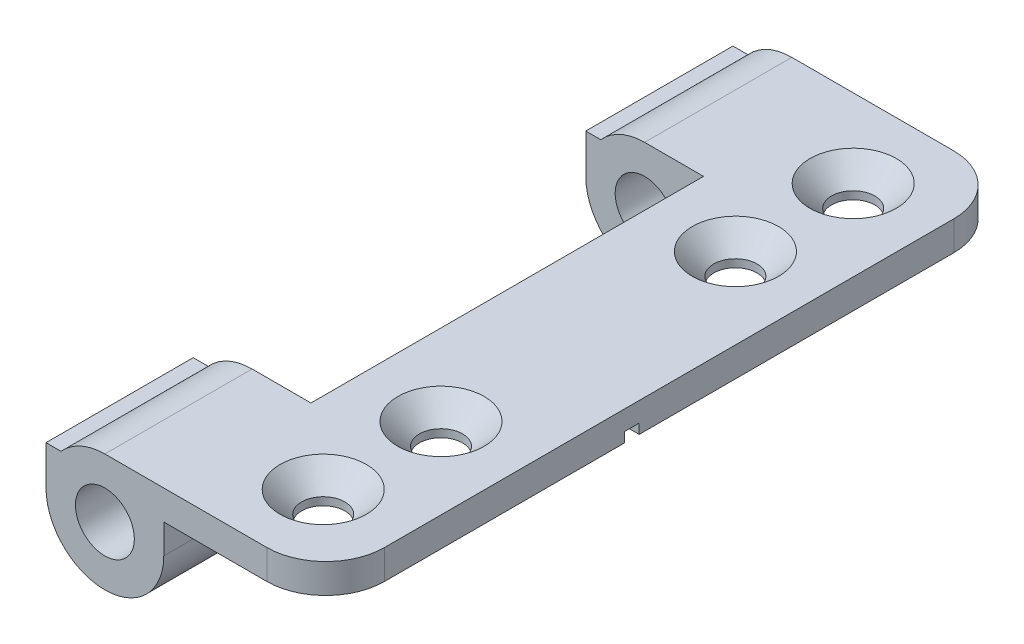
ISO-10303-21;
HEADER;
FILE_DESCRIPTION(('STEP AP214'),'2;1');
FILE_NAME('part.step','',(''),(''),'','','');
FILE_SCHEMA(('AUTOMOTIVE_DESIGN { 1 0 10303 214 1 1 1 1 }'));
ENDSEC;
DATA;
#1=APPLICATION_CONTEXT('core data for automotive mechanical design processes');
#2=APPLICATION_PROTOCOL_DEFINITION('international standard','automotive_design',2000,#1);
#3=PRODUCT_CONTEXT('',#1,'mechanical');
#4=PRODUCT('Part','Part','',(#3));
#5=PRODUCT_RELATED_PRODUCT_CATEGORY('part','',(#4));
#6=PRODUCT_DEFINITION_FORMATION('','',#4);
#7=PRODUCT_DEFINITION_CONTEXT('part definition',#1,'design');
#8=PRODUCT_DEFINITION('design','',#6,#7);
#9=PRODUCT_DEFINITION_SHAPE('','',#8);
#10=(LENGTH_UNIT() NAMED_UNIT(*) SI_UNIT(.MILLI.,.METRE.));
#11=(NAMED_UNIT(*) PLANE_ANGLE_UNIT() SI_UNIT($,.RADIAN.));
#12=(NAMED_UNIT(*) SI_UNIT($,.STERADIAN.) SOLID_ANGLE_UNIT());
#13=UNCERTAINTY_MEASURE_WITH_UNIT(LENGTH_MEASURE(1.E-05),#10,'distance_accuracy_value','');
#14=(GEOMETRIC_REPRESENTATION_CONTEXT(3) GLOBAL_UNCERTAINTY_ASSIGNED_CONTEXT((#13)) GLOBAL_UNIT_ASSIGNED_CONTEXT((#10,
#11,#12)) REPRESENTATION_CONTEXT('',''));
#15=CARTESIAN_POINT('',(0.,0.,0.));
#16=DIRECTION('',(0.,0.,1.));
#17=DIRECTION('',(1.,0.,0.));
#18=AXIS2_PLACEMENT_3D('',#15,#16,#17);
#19=CARTESIAN_POINT('',(11.25,1.5,7.5));
#20=DIRECTION('',(0.,1.,0.));
#21=DIRECTION('',(-1.,0.,0.));
#22=AXIS2_PLACEMENT_3D('',#19,#20,#21);
#23=PLANE('',#22);
#24=CARTESIAN_POINT('',(7.125,1.5,4.));
#25=DIRECTION('',(0.,-1.,0.));
#26=DIRECTION('',(1.,0.,0.));
#27=AXIS2_PLACEMENT_3D('',#24,#25,#26);
#28=CIRCLE('',#27,1.1);
#29=CARTESIAN_POINT('',(8.225,1.5,4.));
#30=VERTEX_POINT('',#29);
#31=EDGE_CURVE('E513',#30,#30,#28,.T.);
#32=ORIENTED_EDGE('',*,*,#31,.F.);
#33=EDGE_LOOP('',(#32));
#34=FACE_BOUND('',#33,.T.);
#35=CARTESIAN_POINT('',(7.125,1.5,10.));
#36=DIRECTION('',(0.,-1.,0.));
#37=DIRECTION('',(1.,0.,0.));
#38=AXIS2_PLACEMENT_3D('',#35,#36,#37);
#39=CIRCLE('',#38,1.1);
#40=CARTESIAN_POINT('',(8.225,1.5,10.));
#41=VERTEX_POINT('',#40);
#42=EDGE_CURVE('E516',#41,#41,#39,.T.);
#43=ORIENTED_EDGE('',*,*,#42,.F.);
#44=EDGE_LOOP('',(#43));
#45=FACE_BOUND('',#44,.T.);
#46=DIRECTION('',(1.,0.,0.));
#47=VECTOR('',#46,1.);
#48=CARTESIAN_POINT('',(11.25,1.5,0.));
#49=LINE('',#48,#47);
#50=CARTESIAN_POINT('',(3.,1.5,0.));
#51=VERTEX_POINT('',#50);
#52=CARTESIAN_POINT('',(8.25,1.5,0.));
#53=VERTEX_POINT('',#52);
#54=EDGE_CURVE('E438',#51,#53,#49,.T.);
#55=ORIENTED_EDGE('',*,*,#54,.T.);
#56=CARTESIAN_POINT('',(8.25,1.5,3.));
#57=DIRECTION('',(0.,1.,0.));
#58=DIRECTION('',(-1.,0.,0.));
#59=AXIS2_PLACEMENT_3D('',#56,#57,#58);
#60=CIRCLE('',#59,3.);
#61=CARTESIAN_POINT('',(11.25,1.5,3.));
#62=VERTEX_POINT('',#61);
#63=EDGE_CURVE('E216',#53,#62,#60,.F.);
#64=ORIENTED_EDGE('',*,*,#63,.T.);
#65=DIRECTION('',(0.,0.,-1.));
#66=VECTOR('',#65,1.);
#67=CARTESIAN_POINT('',(11.25,1.5,7.5));
#68=LINE('',#67,#66);
#69=CARTESIAN_POINT('',(11.25,1.5,19.025));
#70=VERTEX_POINT('',#69);
#71=EDGE_CURVE('E207',#70,#62,#68,.T.);
#72=ORIENTED_EDGE('',*,*,#71,.F.);
#73=DIRECTION('',(-1.,0.,0.));
#74=VECTOR('',#73,1.);
#75=CARTESIAN_POINT('',(11.25,1.5,19.025));
#76=LINE('',#75,#74);
#77=CARTESIAN_POINT('',(3.,1.5,19.025));
#78=VERTEX_POINT('',#77);
#79=EDGE_CURVE('E189',#70,#78,#76,.T.);
#80=ORIENTED_EDGE('',*,*,#79,.T.);
#81=DIRECTION('',(0.,0.,-1.));
#82=VECTOR('',#81,1.);
#83=CARTESIAN_POINT('',(3.,1.5,27.5));
#84=LINE('',#83,#82);
#85=CARTESIAN_POINT('',(3.,1.5,7.5));
#86=VERTEX_POINT('',#85);
#87=EDGE_CURVE('E384',#78,#86,#84,.T.);
#88=ORIENTED_EDGE('',*,*,#87,.T.);
#89=DIRECTION('',(0.,0.,-1.));
#90=VECTOR('',#89,1.);
#91=CARTESIAN_POINT('',(3.,1.5,7.5));
#92=LINE('',#91,#90);
#93=EDGE_CURVE('E223',#86,#51,#92,.T.);
#94=ORIENTED_EDGE('',*,*,#93,.T.);
#95=EDGE_LOOP('',(#55,#64,#72,#80,#88,#94));
#96=FACE_BOUND('',#95,.T.);
#97=ADVANCED_FACE('F43',(#34,#45,#96),#23,.F.);
#98=CARTESIAN_POINT('',(0.,0.,7.5));
#99=DIRECTION('',(0.,0.,1.));
#100=DIRECTION('',(1.,0.,0.));
#101=AXIS2_PLACEMENT_3D('',#98,#99,#100);
#102=PLANE('',#101);
#103=DIRECTION('',(0.,-1.,0.));
#104=VECTOR('',#103,1.);
#105=CARTESIAN_POINT('',(3.,3.,7.5));
#106=LINE('',#105,#104);
#107=CARTESIAN_POINT('',(3.,3.,7.5));
#108=VERTEX_POINT('',#107);
#109=EDGE_CURVE('E379',#108,#86,#106,.T.);
#110=ORIENTED_EDGE('',*,*,#109,.F.);
#111=DIRECTION('',(-1.,0.,0.));
#112=VECTOR('',#111,1.);
#113=CARTESIAN_POINT('',(0.,3.,7.5));
#114=LINE('',#113,#112);
#115=CARTESIAN_POINT('',(0.,3.,7.5));
#116=VERTEX_POINT('',#115);
#117=EDGE_CURVE('E405',#108,#116,#114,.T.);
#118=ORIENTED_EDGE('',*,*,#117,.T.);
#119=CARTESIAN_POINT('',(0.,0.,7.5));
#120=DIRECTION('',(0.,0.,1.));
#121=DIRECTION('',(1.,0.,0.));
#122=AXIS2_PLACEMENT_3D('',#119,#120,#121);
#123=CIRCLE('',#122,3.);
#124=CARTESIAN_POINT('',(-2.23606797749979,2.,7.5));
#125=VERTEX_POINT('',#124);
#126=EDGE_CURVE('E408',#116,#125,#123,.T.);
#127=ORIENTED_EDGE('',*,*,#126,.T.);
#128=DIRECTION('',(-1.,0.,0.));
#129=VECTOR('',#128,1.);
#130=CARTESIAN_POINT('',(-3.,2.,7.5));
#131=LINE('',#130,#129);
#132=CARTESIAN_POINT('',(-3.,2.,7.5));
#133=VERTEX_POINT('',#132);
#134=EDGE_CURVE('E412',#125,#133,#131,.T.);
#135=ORIENTED_EDGE('',*,*,#134,.T.);
#136=DIRECTION('',(0.,-1.,0.));
#137=VECTOR('',#136,1.);
#138=CARTESIAN_POINT('',(-3.,0.,7.5));
#139=LINE('',#138,#137);
#140=CARTESIAN_POINT('',(-3.,0.,7.5));
#141=VERTEX_POINT('',#140);
#142=EDGE_CURVE('E415',#133,#141,#139,.T.);
#143=ORIENTED_EDGE('',*,*,#142,.T.);
#144=CARTESIAN_POINT('',(0.,0.,7.5));
#145=DIRECTION('',(0.,0.,1.));
#146=DIRECTION('',(1.,0.,0.));
#147=AXIS2_PLACEMENT_3D('',#144,#145,#146);
#148=CIRCLE('',#147,3.);
#149=CARTESIAN_POINT('',(3.,0.,7.5));
#150=VERTEX_POINT('',#149);
#151=EDGE_CURVE('E418',#141,#150,#148,.T.);
#152=ORIENTED_EDGE('',*,*,#151,.T.);
#153=DIRECTION('',(0.,1.,0.));
#154=VECTOR('',#153,1.);
#155=CARTESIAN_POINT('',(3.,0.,7.5));
#156=LINE('',#155,#154);
#157=EDGE_CURVE('E225',#150,#86,#156,.T.);
#158=ORIENTED_EDGE('',*,*,#157,.T.);
#159=EDGE_LOOP('',(#110,#118,#127,#135,#143,#152,#158));
#160=FACE_BOUND('',#159,.T.);
#161=CARTESIAN_POINT('',(0.,0.,7.5));
#162=DIRECTION('',(0.,0.,1.));
#163=DIRECTION('',(1.,0.,0.));
#164=AXIS2_PLACEMENT_3D('',#161,#162,#163);
#165=CIRCLE('',#164,1.5);
#166=CARTESIAN_POINT('',(1.5,0.,7.5));
#167=VERTEX_POINT('',#166);
#168=EDGE_CURVE('E397',#167,#167,#165,.T.);
#169=ORIENTED_EDGE('',*,*,#168,.F.);
#170=EDGE_LOOP('',(#169));
#171=FACE_BOUND('',#170,.T.);
#172=ADVANCED_FACE('F454',(#160,#171),#102,.T.);
#173=CARTESIAN_POINT('',(0.,0.,0.));
#174=DIRECTION('',(0.,0.,1.));
#175=DIRECTION('',(1.,0.,0.));
#176=AXIS2_PLACEMENT_3D('',#173,#174,#175);
#177=PLANE('',#176);
#178=DIRECTION('',(-1.,0.,0.));
#179=VECTOR('',#178,1.);
#180=CARTESIAN_POINT('',(3.,3.,0.));
#181=LINE('',#180,#179);
#182=CARTESIAN_POINT('',(8.25,3.,0.));
#183=VERTEX_POINT('',#182);
#184=CARTESIAN_POINT('',(0.,3.,0.));
#185=VERTEX_POINT('',#184);
#186=EDGE_CURVE('E409',#183,#185,#181,.T.);
#187=ORIENTED_EDGE('',*,*,#186,.F.);
#188=DIRECTION('',(0.,1.,0.));
#189=VECTOR('',#188,1.);
#190=CARTESIAN_POINT('',(8.25,0.,0.));
#191=LINE('',#190,#189);
#192=EDGE_CURVE('E65',#183,#53,#191,.F.);
#193=ORIENTED_EDGE('',*,*,#192,.T.);
#194=ORIENTED_EDGE('',*,*,#54,.F.);
#195=DIRECTION('',(0.,1.,0.));
#196=VECTOR('',#195,1.);
#197=CARTESIAN_POINT('',(3.,0.,0.));
#198=LINE('',#197,#196);
#199=CARTESIAN_POINT('',(3.,0.,0.));
#200=VERTEX_POINT('',#199);
#201=EDGE_CURVE('E435',#200,#51,#198,.T.);
#202=ORIENTED_EDGE('',*,*,#201,.F.);
#203=CARTESIAN_POINT('',(0.,0.,0.));
#204=DIRECTION('',(0.,0.,1.));
#205=DIRECTION('',(1.,0.,0.));
#206=AXIS2_PLACEMENT_3D('',#203,#204,#205);
#207=CIRCLE('',#206,3.);
#208=CARTESIAN_POINT('',(-3.,0.,0.));
#209=VERTEX_POINT('',#208);
#210=EDGE_CURVE('E432',#209,#200,#207,.T.);
#211=ORIENTED_EDGE('',*,*,#210,.F.);
#212=DIRECTION('',(0.,-1.,0.));
#213=VECTOR('',#212,1.);
#214=CARTESIAN_POINT('',(-3.,0.,0.));
#215=LINE('',#214,#213);
#216=CARTESIAN_POINT('',(-3.,2.,0.));
#217=VERTEX_POINT('',#216);
#218=EDGE_CURVE('E429',#217,#209,#215,.T.);
#219=ORIENTED_EDGE('',*,*,#218,.F.);
#220=DIRECTION('',(-1.,0.,0.));
#221=VECTOR('',#220,1.);
#222=CARTESIAN_POINT('',(-3.,2.,0.));
#223=LINE('',#222,#221);
#224=CARTESIAN_POINT('',(-2.23606797749979,2.,0.));
#225=VERTEX_POINT('',#224);
#226=EDGE_CURVE('E426',#225,#217,#223,.T.);
#227=ORIENTED_EDGE('',*,*,#226,.F.);
#228=CARTESIAN_POINT('',(0.,0.,0.));
#229=DIRECTION('',(0.,0.,1.));
#230=DIRECTION('',(1.,0.,0.));
#231=AXIS2_PLACEMENT_3D('',#228,#229,#230);
#232=CIRCLE('',#231,3.);
#233=EDGE_CURVE('E401',#185,#225,#232,.T.);
#234=ORIENTED_EDGE('',*,*,#233,.F.);
#235=EDGE_LOOP('',(#187,#193,#194,#202,#211,#219,#227,#234));
#236=FACE_BOUND('',#235,.T.);
#237=CARTESIAN_POINT('',(0.,0.,0.));
#238=DIRECTION('',(0.,0.,1.));
#239=DIRECTION('',(1.,0.,0.));
#240=AXIS2_PLACEMENT_3D('',#237,#238,#239);
#241=CIRCLE('',#240,1.5);
#242=CARTESIAN_POINT('',(1.5,0.,0.));
#243=VERTEX_POINT('',#242);
#244=EDGE_CURVE('E396',#243,#243,#241,.T.);
#245=ORIENTED_EDGE('',*,*,#244,.T.);
#246=EDGE_LOOP('',(#245));
#247=FACE_BOUND('',#246,.T.);
#248=ADVANCED_FACE('F445',(#236,#247),#177,.F.);
#249=CARTESIAN_POINT('',(0.,0.,7.5));
#250=DIRECTION('',(0.,0.,-1.));
#251=DIRECTION('',(-1.,0.,0.));
#252=AXIS2_PLACEMENT_3D('',#249,#250,#251);
#253=CYLINDRICAL_SURFACE('',#252,3.);
#254=ORIENTED_EDGE('',*,*,#233,.T.);
#255=DIRECTION('',(0.,0.,-1.));
#256=VECTOR('',#255,1.);
#257=CARTESIAN_POINT('',(-2.23606797749979,2.,7.5));
#258=LINE('',#257,#256);
#259=EDGE_CURVE('E244',#125,#225,#258,.T.);
#260=ORIENTED_EDGE('',*,*,#259,.F.);
#261=ORIENTED_EDGE('',*,*,#126,.F.);
#262=DIRECTION('',(0.,0.,-1.));
#263=VECTOR('',#262,1.);
#264=CARTESIAN_POINT('',(0.,3.,7.5));
#265=LINE('',#264,#263);
#266=EDGE_CURVE('E248',#116,#185,#265,.T.);
#267=ORIENTED_EDGE('',*,*,#266,.T.);
#268=EDGE_LOOP('',(#254,#260,#261,#267));
#269=FACE_BOUND('',#268,.T.);
#270=ADVANCED_FACE('F451',(#269),#253,.T.);
#271=CARTESIAN_POINT('',(-3.,2.,7.5));
#272=DIRECTION('',(0.,-1.,0.));
#273=DIRECTION('',(0.,0.,-1.));
#274=AXIS2_PLACEMENT_3D('',#271,#272,#273);
#275=PLANE('',#274);
#276=ORIENTED_EDGE('',*,*,#226,.T.);
#277=DIRECTION('',(0.,0.,-1.));
#278=VECTOR('',#277,1.);
#279=CARTESIAN_POINT('',(-3.,2.,7.5));
#280=LINE('',#279,#278);
#281=EDGE_CURVE('E240',#133,#217,#280,.T.);
#282=ORIENTED_EDGE('',*,*,#281,.F.);
#283=ORIENTED_EDGE('',*,*,#134,.F.);
#284=ORIENTED_EDGE('',*,*,#259,.T.);
#285=EDGE_LOOP('',(#276,#282,#283,#284));
#286=FACE_BOUND('',#285,.T.);
#287=ADVANCED_FACE('F643',(#286),#275,.F.);
#288=CARTESIAN_POINT('',(-3.,0.,7.5));
#289=DIRECTION('',(1.,0.,0.));
#290=DIRECTION('',(0.,1.,0.));
#291=AXIS2_PLACEMENT_3D('',#288,#289,#290);
#292=PLANE('',#291);
#293=ORIENTED_EDGE('',*,*,#218,.T.);
#294=DIRECTION('',(0.,0.,-1.));
#295=VECTOR('',#294,1.);
#296=CARTESIAN_POINT('',(-3.,0.,7.5));
#297=LINE('',#296,#295);
#298=EDGE_CURVE('E236',#141,#209,#297,.T.);
#299=ORIENTED_EDGE('',*,*,#298,.F.);
#300=ORIENTED_EDGE('',*,*,#142,.F.);
#301=ORIENTED_EDGE('',*,*,#281,.T.);
#302=EDGE_LOOP('',(#293,#299,#300,#301));
#303=FACE_BOUND('',#302,.T.);
#304=ADVANCED_FACE('F646',(#303),#292,.F.);
#305=CARTESIAN_POINT('',(0.,0.,7.5));
#306=DIRECTION('',(0.,0.,-1.));
#307=DIRECTION('',(-1.,0.,0.));
#308=AXIS2_PLACEMENT_3D('',#305,#306,#307);
#309=CYLINDRICAL_SURFACE('',#308,3.);
#310=ORIENTED_EDGE('',*,*,#210,.T.);
#311=DIRECTION('',(0.,0.,-1.));
#312=VECTOR('',#311,1.);
#313=CARTESIAN_POINT('',(3.,0.,7.5));
#314=LINE('',#313,#312);
#315=EDGE_CURVE('E232',#150,#200,#314,.T.);
#316=ORIENTED_EDGE('',*,*,#315,.F.);
#317=ORIENTED_EDGE('',*,*,#151,.F.);
#318=ORIENTED_EDGE('',*,*,#298,.T.);
#319=EDGE_LOOP('',(#310,#316,#317,#318));
#320=FACE_BOUND('',#319,.T.);
#321=ADVANCED_FACE('F499',(#320),#309,.T.);
#322=CARTESIAN_POINT('',(3.,0.,7.5));
#323=DIRECTION('',(-1.,0.,0.));
#324=DIRECTION('',(0.,-1.,0.));
#325=AXIS2_PLACEMENT_3D('',#322,#323,#324);
#326=PLANE('',#325);
#327=ORIENTED_EDGE('',*,*,#201,.T.);
#328=ORIENTED_EDGE('',*,*,#93,.F.);
#329=ORIENTED_EDGE('',*,*,#157,.F.);
#330=ORIENTED_EDGE('',*,*,#315,.T.);
#331=EDGE_LOOP('',(#327,#328,#329,#330));
#332=FACE_BOUND('',#331,.T.);
#333=ADVANCED_FACE('F491',(#332),#326,.F.);
#334=CARTESIAN_POINT('',(7.125,1.5,31.));
#335=DIRECTION('',(0.,-1.,0.));
#336=DIRECTION('',(1.,0.,0.));
#337=AXIS2_PLACEMENT_3D('',#334,#335,#336);
#338=CIRCLE('',#337,1.1);
#339=CARTESIAN_POINT('',(8.225,1.5,31.));
#340=VERTEX_POINT('',#339);
#341=EDGE_CURVE('E520',#340,#340,#338,.T.);
#342=ORIENTED_EDGE('',*,*,#341,.F.);
#343=EDGE_LOOP('',(#342));
#344=FACE_BOUND('',#343,.T.);
#345=CARTESIAN_POINT('',(7.125,1.5,25.));
#346=DIRECTION('',(0.,-1.,0.));
#347=DIRECTION('',(1.,0.,0.));
#348=AXIS2_PLACEMENT_3D('',#345,#346,#347);
#349=CIRCLE('',#348,1.1);
#350=CARTESIAN_POINT('',(8.225,1.5,25.));
#351=VERTEX_POINT('',#350);
#352=EDGE_CURVE('E519',#351,#351,#349,.T.);
#353=ORIENTED_EDGE('',*,*,#352,.F.);
#354=EDGE_LOOP('',(#353));
#355=FACE_BOUND('',#354,.T.);
#356=CARTESIAN_POINT('',(11.25,1.5,32.));
#357=VERTEX_POINT('',#356);
#358=CARTESIAN_POINT('',(11.25,1.5,19.775));
#359=VERTEX_POINT('',#358);
#360=EDGE_CURVE('E218',#357,#359,#68,.T.);
#361=ORIENTED_EDGE('',*,*,#360,.F.);
#362=CARTESIAN_POINT('',(8.25,1.5,32.));
#363=DIRECTION('',(0.,1.,0.));
#364=DIRECTION('',(-1.,0.,0.));
#365=AXIS2_PLACEMENT_3D('',#362,#363,#364);
#366=CIRCLE('',#365,3.);
#367=CARTESIAN_POINT('',(8.25,1.5,35.));
#368=VERTEX_POINT('',#367);
#369=EDGE_CURVE('E11',#357,#368,#366,.F.);
#370=ORIENTED_EDGE('',*,*,#369,.T.);
#371=DIRECTION('',(1.,0.,0.));
#372=VECTOR('',#371,1.);
#373=CARTESIAN_POINT('',(3.,1.5,35.));
#374=LINE('',#373,#372);
#375=CARTESIAN_POINT('',(3.,1.5,35.));
#376=VERTEX_POINT('',#375);
#377=EDGE_CURVE('E308',#376,#368,#374,.T.);
#378=ORIENTED_EDGE('',*,*,#377,.F.);
#379=DIRECTION('',(0.,0.,-1.));
#380=VECTOR('',#379,1.);
#381=CARTESIAN_POINT('',(3.,1.5,35.));
#382=LINE('',#381,#380);
#383=CARTESIAN_POINT('',(3.,1.5,27.5));
#384=VERTEX_POINT('',#383);
#385=EDGE_CURVE('E338',#376,#384,#382,.T.);
#386=ORIENTED_EDGE('',*,*,#385,.T.);
#387=CARTESIAN_POINT('',(3.,1.5,19.775));
#388=VERTEX_POINT('',#387);
#389=EDGE_CURVE('E388',#384,#388,#84,.T.);
#390=ORIENTED_EDGE('',*,*,#389,.T.);
#391=DIRECTION('',(-1.,0.,0.));
#392=VECTOR('',#391,1.);
#393=CARTESIAN_POINT('',(11.25,1.5,19.775));
#394=LINE('',#393,#392);
#395=EDGE_CURVE('E200',#359,#388,#394,.T.);
#396=ORIENTED_EDGE('',*,*,#395,.F.);
#397=EDGE_LOOP('',(#361,#370,#378,#386,#390,#396));
#398=FACE_BOUND('',#397,.T.);
#399=ADVANCED_FACE('F488',(#344,#355,#398),#23,.F.);
#400=CARTESIAN_POINT('',(11.25,3.,7.5));
#401=DIRECTION('',(-1.,0.,0.));
#402=DIRECTION('',(0.,0.,1.));
#403=AXIS2_PLACEMENT_3D('',#400,#401,#402);
#404=PLANE('',#403);
#405=ORIENTED_EDGE('',*,*,#71,.T.);
#406=DIRECTION('',(0.,1.,0.));
#407=VECTOR('',#406,1.);
#408=CARTESIAN_POINT('',(11.25,3.,3.));
#409=LINE('',#408,#407);
#410=CARTESIAN_POINT('',(11.25,3.,3.));
#411=VERTEX_POINT('',#410);
#412=EDGE_CURVE('E287',#62,#411,#409,.T.);
#413=ORIENTED_EDGE('',*,*,#412,.T.);
#414=DIRECTION('',(0.,0.,-1.));
#415=VECTOR('',#414,1.);
#416=CARTESIAN_POINT('',(11.25,3.,7.5));
#417=LINE('',#416,#415);
#418=CARTESIAN_POINT('',(11.25,3.,32.));
#419=VERTEX_POINT('',#418);
#420=EDGE_CURVE('E219',#419,#411,#417,.T.);
#421=ORIENTED_EDGE('',*,*,#420,.F.);
#422=DIRECTION('',(0.,1.,0.));
#423=VECTOR('',#422,1.);
#424=CARTESIAN_POINT('',(11.25,1.5,32.));
#425=LINE('',#424,#423);
#426=EDGE_CURVE('E284',#419,#357,#425,.F.);
#427=ORIENTED_EDGE('',*,*,#426,.T.);
#428=ORIENTED_EDGE('',*,*,#360,.T.);
#429=DIRECTION('',(0.,1.,0.));
#430=VECTOR('',#429,1.);
#431=CARTESIAN_POINT('',(11.25,1.5,19.775));
#432=LINE('',#431,#430);
#433=CARTESIAN_POINT('',(11.25,2.,19.775));
#434=VERTEX_POINT('',#433);
#435=EDGE_CURVE('E212',#359,#434,#432,.T.);
#436=ORIENTED_EDGE('',*,*,#435,.T.);
#437=DIRECTION('',(0.,0.,-1.));
#438=VECTOR('',#437,1.);
#439=CARTESIAN_POINT('',(11.25,2.,19.025));
#440=LINE('',#439,#438);
#441=CARTESIAN_POINT('',(11.25,2.,19.025));
#442=VERTEX_POINT('',#441);
#443=EDGE_CURVE('E201',#434,#442,#440,.T.);
#444=ORIENTED_EDGE('',*,*,#443,.T.);
#445=DIRECTION('',(0.,-1.,0.));
#446=VECTOR('',#445,1.);
#447=CARTESIAN_POINT('',(11.25,1.5,19.025));
#448=LINE('',#447,#446);
#449=EDGE_CURVE('E192',#442,#70,#448,.T.);
#450=ORIENTED_EDGE('',*,*,#449,.T.);
#451=EDGE_LOOP('',(#405,#413,#421,#427,#428,#436,#444,#450));
#452=FACE_BOUND('',#451,.T.);
#453=ADVANCED_FACE('F205',(#452),#404,.F.);
#454=CARTESIAN_POINT('',(3.,3.,7.5));
#455=DIRECTION('',(0.,-1.,0.));
#456=DIRECTION('',(0.,0.,-1.));
#457=AXIS2_PLACEMENT_3D('',#454,#455,#456);
#458=PLANE('',#457);
#459=CARTESIAN_POINT('',(7.125,3.,31.));
#460=DIRECTION('',(0.,-1.,0.));
#461=DIRECTION('',(0.,0.,-1.));
#462=AXIS2_PLACEMENT_3D('',#459,#460,#461);
#463=CIRCLE('',#462,2.2);
#464=CARTESIAN_POINT('',(7.125,3.,28.8));
#465=VERTEX_POINT('',#464);
#466=EDGE_CURVE('E264',#465,#465,#463,.T.);
#467=ORIENTED_EDGE('',*,*,#466,.T.);
#468=EDGE_LOOP('',(#467));
#469=FACE_BOUND('',#468,.T.);
#470=CARTESIAN_POINT('',(7.125,3.,25.));
#471=DIRECTION('',(0.,-1.,0.));
#472=DIRECTION('',(0.,0.,-1.));
#473=AXIS2_PLACEMENT_3D('',#470,#471,#472);
#474=CIRCLE('',#473,2.2);
#475=CARTESIAN_POINT('',(7.125,3.,22.8));
#476=VERTEX_POINT('',#475);
#477=EDGE_CURVE('E260',#476,#476,#474,.T.);
#478=ORIENTED_EDGE('',*,*,#477,.T.);
#479=EDGE_LOOP('',(#478));
#480=FACE_BOUND('',#479,.T.);
#481=CARTESIAN_POINT('',(7.125,3.,10.));
#482=DIRECTION('',(0.,-1.,0.));
#483=DIRECTION('',(0.,0.,-1.));
#484=AXIS2_PLACEMENT_3D('',#481,#482,#483);
#485=CIRCLE('',#484,2.2);
#486=CARTESIAN_POINT('',(7.125,3.,7.80000000000001));
#487=VERTEX_POINT('',#486);
#488=EDGE_CURVE('E256',#487,#487,#485,.T.);
#489=ORIENTED_EDGE('',*,*,#488,.T.);
#490=EDGE_LOOP('',(#489));
#491=FACE_BOUND('',#490,.T.);
#492=CARTESIAN_POINT('',(7.125,3.,4.));
#493=DIRECTION('',(0.,-1.,0.));
#494=DIRECTION('',(0.,0.,-1.));
#495=AXIS2_PLACEMENT_3D('',#492,#493,#494);
#496=CIRCLE('',#495,2.2);
#497=CARTESIAN_POINT('',(7.125,3.,1.8));
#498=VERTEX_POINT('',#497);
#499=EDGE_CURVE('E252',#498,#498,#496,.T.);
#500=ORIENTED_EDGE('',*,*,#499,.T.);
#501=EDGE_LOOP('',(#500));
#502=FACE_BOUND('',#501,.T.);
#503=ORIENTED_EDGE('',*,*,#420,.T.);
#504=CARTESIAN_POINT('',(8.25,3.,3.));
#505=DIRECTION('',(0.,-1.,0.));
#506=DIRECTION('',(0.,0.,-1.));
#507=AXIS2_PLACEMENT_3D('',#504,#505,#506);
#508=CIRCLE('',#507,3.);
#509=EDGE_CURVE('E293',#411,#183,#508,.F.);
#510=ORIENTED_EDGE('',*,*,#509,.T.);
#511=ORIENTED_EDGE('',*,*,#186,.T.);
#512=ORIENTED_EDGE('',*,*,#266,.F.);
#513=ORIENTED_EDGE('',*,*,#117,.F.);
#514=DIRECTION('',(0.,0.,-1.));
#515=VECTOR('',#514,1.);
#516=CARTESIAN_POINT('',(3.,3.,27.5));
#517=LINE('',#516,#515);
#518=CARTESIAN_POINT('',(3.,3.,27.5));
#519=VERTEX_POINT('',#518);
#520=EDGE_CURVE('E392',#519,#108,#517,.T.);
#521=ORIENTED_EDGE('',*,*,#520,.F.);
#522=DIRECTION('',(-1.,0.,0.));
#523=VECTOR('',#522,1.);
#524=CARTESIAN_POINT('',(3.,3.,27.5));
#525=LINE('',#524,#523);
#526=CARTESIAN_POINT('',(0.,3.,27.5));
#527=VERTEX_POINT('',#526);
#528=EDGE_CURVE('E339',#519,#527,#525,.T.);
#529=ORIENTED_EDGE('',*,*,#528,.T.);
#530=DIRECTION('',(0.,0.,-1.));
#531=VECTOR('',#530,1.);
#532=CARTESIAN_POINT('',(0.,3.,35.));
#533=LINE('',#532,#531);
#534=CARTESIAN_POINT('',(0.,3.,35.));
#535=VERTEX_POINT('',#534);
#536=EDGE_CURVE('E314',#535,#527,#533,.T.);
#537=ORIENTED_EDGE('',*,*,#536,.F.);
#538=DIRECTION('',(-1.,0.,0.));
#539=VECTOR('',#538,1.);
#540=CARTESIAN_POINT('',(11.25,3.,35.));
#541=LINE('',#540,#539);
#542=CARTESIAN_POINT('',(8.25,3.,35.));
#543=VERTEX_POINT('',#542);
#544=EDGE_CURVE('E306',#543,#535,#541,.T.);
#545=ORIENTED_EDGE('',*,*,#544,.F.);
#546=CARTESIAN_POINT('',(8.25,3.,32.));
#547=DIRECTION('',(0.,-1.,0.));
#548=DIRECTION('',(0.,0.,-1.));
#549=AXIS2_PLACEMENT_3D('',#546,#547,#548);
#550=CIRCLE('',#549,3.);
#551=EDGE_CURVE('E290',#543,#419,#550,.F.);
#552=ORIENTED_EDGE('',*,*,#551,.T.);
#553=EDGE_LOOP('',(#503,#510,#511,#512,#513,#521,#529,#537,#545,#552));
#554=FACE_BOUND('',#553,.T.);
#555=ADVANCED_FACE('F311',(#469,#480,#491,#502,#554),#458,.F.);
#556=CARTESIAN_POINT('',(0.,0.,7.5));
#557=DIRECTION('',(0.,0.,-1.));
#558=DIRECTION('',(-1.,0.,0.));
#559=AXIS2_PLACEMENT_3D('',#556,#557,#558);
#560=CYLINDRICAL_SURFACE('',#559,1.5);
#561=ORIENTED_EDGE('',*,*,#168,.T.);
#562=EDGE_LOOP('',(#561));
#563=FACE_BOUND('',#562,.T.);
#564=ORIENTED_EDGE('',*,*,#244,.F.);
#565=EDGE_LOOP('',(#564));
#566=FACE_BOUND('',#565,.T.);
#567=ADVANCED_FACE('F587',(#563,#566),#560,.F.);
#568=CARTESIAN_POINT('',(3.,3.,27.5));
#569=DIRECTION('',(1.,0.,0.));
#570=DIRECTION('',(0.,1.,0.));
#571=AXIS2_PLACEMENT_3D('',#568,#569,#570);
#572=PLANE('',#571);
#573=ORIENTED_EDGE('',*,*,#87,.F.);
#574=DIRECTION('',(0.,-1.,0.));
#575=VECTOR('',#574,1.);
#576=CARTESIAN_POINT('',(3.,1.5,19.025));
#577=LINE('',#576,#575);
#578=CARTESIAN_POINT('',(3.,2.,19.025));
#579=VERTEX_POINT('',#578);
#580=EDGE_CURVE('E195',#579,#78,#577,.T.);
#581=ORIENTED_EDGE('',*,*,#580,.F.);
#582=DIRECTION('',(0.,0.,-1.));
#583=VECTOR('',#582,1.);
#584=CARTESIAN_POINT('',(3.,2.,19.025));
#585=LINE('',#584,#583);
#586=CARTESIAN_POINT('',(3.,2.,19.775));
#587=VERTEX_POINT('',#586);
#588=EDGE_CURVE('E213',#587,#579,#585,.T.);
#589=ORIENTED_EDGE('',*,*,#588,.F.);
#590=DIRECTION('',(0.,1.,0.));
#591=VECTOR('',#590,1.);
#592=CARTESIAN_POINT('',(3.,1.5,19.775));
#593=LINE('',#592,#591);
#594=EDGE_CURVE('E537',#388,#587,#593,.T.);
#595=ORIENTED_EDGE('',*,*,#594,.F.);
#596=ORIENTED_EDGE('',*,*,#389,.F.);
#597=DIRECTION('',(0.,-1.,0.));
#598=VECTOR('',#597,1.);
#599=CARTESIAN_POINT('',(3.,3.,27.5));
#600=LINE('',#599,#598);
#601=EDGE_CURVE('E380',#519,#384,#600,.T.);
#602=ORIENTED_EDGE('',*,*,#601,.F.);
#603=ORIENTED_EDGE('',*,*,#520,.T.);
#604=ORIENTED_EDGE('',*,*,#109,.T.);
#605=EDGE_LOOP('',(#573,#581,#589,#595,#596,#602,#603,#604));
#606=FACE_BOUND('',#605,.T.);
#607=ADVANCED_FACE('F459',(#606),#572,.F.);
#608=CARTESIAN_POINT('',(0.,0.,27.5));
#609=DIRECTION('',(0.,0.,1.));
#610=DIRECTION('',(1.,0.,0.));
#611=AXIS2_PLACEMENT_3D('',#608,#609,#610);
#612=PLANE('',#611);
#613=CARTESIAN_POINT('',(0.,0.,27.5));
#614=DIRECTION('',(0.,0.,1.));
#615=DIRECTION('',(1.,0.,0.));
#616=AXIS2_PLACEMENT_3D('',#613,#614,#615);
#617=CIRCLE('',#616,1.5);
#618=CARTESIAN_POINT('',(1.5,0.,27.5));
#619=VERTEX_POINT('',#618);
#620=EDGE_CURVE('E547',#619,#619,#617,.T.);
#621=ORIENTED_EDGE('',*,*,#620,.T.);
#622=EDGE_LOOP('',(#621));
#623=FACE_BOUND('',#622,.T.);
#624=ORIENTED_EDGE('',*,*,#528,.F.);
#625=ORIENTED_EDGE('',*,*,#601,.T.);
#626=DIRECTION('',(0.,1.,0.));
#627=VECTOR('',#626,1.);
#628=CARTESIAN_POINT('',(3.,0.,27.5));
#629=LINE('',#628,#627);
#630=CARTESIAN_POINT('',(3.,0.,27.5));
#631=VERTEX_POINT('',#630);
#632=EDGE_CURVE('E323',#631,#384,#629,.T.);
#633=ORIENTED_EDGE('',*,*,#632,.F.);
#634=CARTESIAN_POINT('',(0.,0.,27.5));
#635=DIRECTION('',(0.,0.,1.));
#636=DIRECTION('',(1.,0.,0.));
#637=AXIS2_PLACEMENT_3D('',#634,#635,#636);
#638=CIRCLE('',#637,3.);
#639=CARTESIAN_POINT('',(-3.,0.,27.5));
#640=VERTEX_POINT('',#639);
#641=EDGE_CURVE('E352',#640,#631,#638,.T.);
#642=ORIENTED_EDGE('',*,*,#641,.F.);
#643=DIRECTION('',(0.,-1.,0.));
#644=VECTOR('',#643,1.);
#645=CARTESIAN_POINT('',(-3.,2.,27.5));
#646=LINE('',#645,#644);
#647=CARTESIAN_POINT('',(-3.,2.,27.5));
#648=VERTEX_POINT('',#647);
#649=EDGE_CURVE('E349',#648,#640,#646,.T.);
#650=ORIENTED_EDGE('',*,*,#649,.F.);
#651=DIRECTION('',(-1.,0.,0.));
#652=VECTOR('',#651,1.);
#653=CARTESIAN_POINT('',(-2.23606797749979,2.,27.5));
#654=LINE('',#653,#652);
#655=CARTESIAN_POINT('',(-2.23606797749979,2.,27.5));
#656=VERTEX_POINT('',#655);
#657=EDGE_CURVE('E346',#656,#648,#654,.T.);
#658=ORIENTED_EDGE('',*,*,#657,.F.);
#659=CARTESIAN_POINT('',(0.,0.,27.5));
#660=DIRECTION('',(0.,0.,1.));
#661=DIRECTION('',(1.,0.,0.));
#662=AXIS2_PLACEMENT_3D('',#659,#660,#661);
#663=CIRCLE('',#662,3.);
#664=EDGE_CURVE('E342',#527,#656,#663,.T.);
#665=ORIENTED_EDGE('',*,*,#664,.F.);
#666=EDGE_LOOP('',(#624,#625,#633,#642,#650,#658,#665));
#667=FACE_BOUND('',#666,.T.);
#668=ADVANCED_FACE('F465',(#623,#667),#612,.F.);
#669=CARTESIAN_POINT('',(0.,0.,35.));
#670=DIRECTION('',(0.,0.,1.));
#671=DIRECTION('',(1.,0.,0.));
#672=AXIS2_PLACEMENT_3D('',#669,#670,#671);
#673=PLANE('',#672);
#674=ORIENTED_EDGE('',*,*,#377,.T.);
#675=DIRECTION('',(0.,1.,0.));
#676=VECTOR('',#675,1.);
#677=CARTESIAN_POINT('',(8.25,3.,35.));
#678=LINE('',#677,#676);
#679=EDGE_CURVE('E52',#368,#543,#678,.T.);
#680=ORIENTED_EDGE('',*,*,#679,.T.);
#681=ORIENTED_EDGE('',*,*,#544,.T.);
#682=CARTESIAN_POINT('',(0.,0.,35.));
#683=DIRECTION('',(0.,0.,1.));
#684=DIRECTION('',(1.,0.,0.));
#685=AXIS2_PLACEMENT_3D('',#682,#683,#684);
#686=CIRCLE('',#685,3.);
#687=CARTESIAN_POINT('',(-2.23606797749979,2.,35.));
#688=VERTEX_POINT('',#687);
#689=EDGE_CURVE('E317',#535,#688,#686,.T.);
#690=ORIENTED_EDGE('',*,*,#689,.T.);
#691=DIRECTION('',(-1.,0.,0.));
#692=VECTOR('',#691,1.);
#693=CARTESIAN_POINT('',(-2.23606797749979,2.,35.));
#694=LINE('',#693,#692);
#695=CARTESIAN_POINT('',(-3.,2.,35.));
#696=VERTEX_POINT('',#695);
#697=EDGE_CURVE('E321',#688,#696,#694,.T.);
#698=ORIENTED_EDGE('',*,*,#697,.T.);
#699=DIRECTION('',(0.,-1.,0.));
#700=VECTOR('',#699,1.);
#701=CARTESIAN_POINT('',(-3.,2.,35.));
#702=LINE('',#701,#700);
#703=CARTESIAN_POINT('',(-3.,0.,35.));
#704=VERTEX_POINT('',#703);
#705=EDGE_CURVE('E329',#696,#704,#702,.T.);
#706=ORIENTED_EDGE('',*,*,#705,.T.);
#707=CARTESIAN_POINT('',(0.,0.,35.));
#708=DIRECTION('',(0.,0.,1.));
#709=DIRECTION('',(1.,0.,0.));
#710=AXIS2_PLACEMENT_3D('',#707,#708,#709);
#711=CIRCLE('',#710,3.);
#712=CARTESIAN_POINT('',(3.,0.,35.));
#713=VERTEX_POINT('',#712);
#714=EDGE_CURVE('E332',#704,#713,#711,.T.);
#715=ORIENTED_EDGE('',*,*,#714,.T.);
#716=DIRECTION('',(0.,1.,0.));
#717=VECTOR('',#716,1.);
#718=CARTESIAN_POINT('',(3.,0.,35.));
#719=LINE('',#718,#717);
#720=EDGE_CURVE('E335',#713,#376,#719,.T.);
#721=ORIENTED_EDGE('',*,*,#720,.T.);
#722=EDGE_LOOP('',(#674,#680,#681,#690,#698,#706,#715,#721));
#723=FACE_BOUND('',#722,.T.);
#724=CARTESIAN_POINT('',(0.,0.,35.));
#725=DIRECTION('',(0.,0.,1.));
#726=DIRECTION('',(1.,0.,0.));
#727=AXIS2_PLACEMENT_3D('',#724,#725,#726);
#728=CIRCLE('',#727,1.5);
#729=CARTESIAN_POINT('',(1.5,0.,35.));
#730=VERTEX_POINT('',#729);
#731=EDGE_CURVE('E343',#730,#730,#728,.T.);
#732=ORIENTED_EDGE('',*,*,#731,.F.);
#733=EDGE_LOOP('',(#732));
#734=FACE_BOUND('',#733,.T.);
#735=ADVANCED_FACE('F304',(#723,#734),#673,.T.);
#736=CARTESIAN_POINT('',(0.,0.,35.));
#737=DIRECTION('',(0.,0.,-1.));
#738=DIRECTION('',(-1.,0.,0.));
#739=AXIS2_PLACEMENT_3D('',#736,#737,#738);
#740=CYLINDRICAL_SURFACE('',#739,3.);
#741=ORIENTED_EDGE('',*,*,#664,.T.);
#742=DIRECTION('',(0.,0.,-1.));
#743=VECTOR('',#742,1.);
#744=CARTESIAN_POINT('',(-2.23606797749979,2.,35.));
#745=LINE('',#744,#743);
#746=EDGE_CURVE('E373',#688,#656,#745,.T.);
#747=ORIENTED_EDGE('',*,*,#746,.F.);
#748=ORIENTED_EDGE('',*,*,#689,.F.);
#749=ORIENTED_EDGE('',*,*,#536,.T.);
#750=EDGE_LOOP('',(#741,#747,#748,#749));
#751=FACE_BOUND('',#750,.T.);
#752=ADVANCED_FACE('F468',(#751),#740,.T.);
#753=CARTESIAN_POINT('',(-2.23606797749979,2.,35.));
#754=DIRECTION('',(0.,-1.,0.));
#755=DIRECTION('',(0.,0.,-1.));
#756=AXIS2_PLACEMENT_3D('',#753,#754,#755);
#757=PLANE('',#756);
#758=ORIENTED_EDGE('',*,*,#657,.T.);
#759=DIRECTION('',(0.,0.,-1.));
#760=VECTOR('',#759,1.);
#761=CARTESIAN_POINT('',(-3.,2.,35.));
#762=LINE('',#761,#760);
#763=EDGE_CURVE('E369',#696,#648,#762,.T.);
#764=ORIENTED_EDGE('',*,*,#763,.F.);
#765=ORIENTED_EDGE('',*,*,#697,.F.);
#766=ORIENTED_EDGE('',*,*,#746,.T.);
#767=EDGE_LOOP('',(#758,#764,#765,#766));
#768=FACE_BOUND('',#767,.T.);
#769=ADVANCED_FACE('F475',(#768),#757,.F.);
#770=CARTESIAN_POINT('',(-3.,2.,35.));
#771=DIRECTION('',(1.,0.,0.));
#772=DIRECTION('',(0.,1.,0.));
#773=AXIS2_PLACEMENT_3D('',#770,#771,#772);
#774=PLANE('',#773);
#775=ORIENTED_EDGE('',*,*,#649,.T.);
#776=DIRECTION('',(0.,0.,-1.));
#777=VECTOR('',#776,1.);
#778=CARTESIAN_POINT('',(-3.,0.,35.));
#779=LINE('',#778,#777);
#780=EDGE_CURVE('E365',#704,#640,#779,.T.);
#781=ORIENTED_EDGE('',*,*,#780,.F.);
#782=ORIENTED_EDGE('',*,*,#705,.F.);
#783=ORIENTED_EDGE('',*,*,#763,.T.);
#784=EDGE_LOOP('',(#775,#781,#782,#783));
#785=FACE_BOUND('',#784,.T.);
#786=ADVANCED_FACE('F478',(#785),#774,.F.);
#787=CARTESIAN_POINT('',(0.,0.,35.));
#788=DIRECTION('',(0.,0.,-1.));
#789=DIRECTION('',(-1.,0.,0.));
#790=AXIS2_PLACEMENT_3D('',#787,#788,#789);
#791=CYLINDRICAL_SURFACE('',#790,3.);
#792=ORIENTED_EDGE('',*,*,#641,.T.);
#793=DIRECTION('',(0.,0.,-1.));
#794=VECTOR('',#793,1.);
#795=CARTESIAN_POINT('',(3.,0.,35.));
#796=LINE('',#795,#794);
#797=EDGE_CURVE('E361',#713,#631,#796,.T.);
#798=ORIENTED_EDGE('',*,*,#797,.F.);
#799=ORIENTED_EDGE('',*,*,#714,.F.);
#800=ORIENTED_EDGE('',*,*,#780,.T.);
#801=EDGE_LOOP('',(#792,#798,#799,#800));
#802=FACE_BOUND('',#801,.T.);
#803=ADVANCED_FACE('F483',(#802),#791,.T.);
#804=CARTESIAN_POINT('',(3.,0.,35.));
#805=DIRECTION('',(-1.,0.,0.));
#806=DIRECTION('',(0.,-1.,0.));
#807=AXIS2_PLACEMENT_3D('',#804,#805,#806);
#808=PLANE('',#807);
#809=ORIENTED_EDGE('',*,*,#632,.T.);
#810=ORIENTED_EDGE('',*,*,#385,.F.);
#811=ORIENTED_EDGE('',*,*,#720,.F.);
#812=ORIENTED_EDGE('',*,*,#797,.T.);
#813=EDGE_LOOP('',(#809,#810,#811,#812));
#814=FACE_BOUND('',#813,.T.);
#815=ADVANCED_FACE('F487',(#814),#808,.F.);
#816=CARTESIAN_POINT('',(0.,0.,35.));
#817=DIRECTION('',(0.,0.,-1.));
#818=DIRECTION('',(-1.,0.,0.));
#819=AXIS2_PLACEMENT_3D('',#816,#817,#818);
#820=CYLINDRICAL_SURFACE('',#819,1.5);
#821=ORIENTED_EDGE('',*,*,#731,.T.);
#822=EDGE_LOOP('',(#821));
#823=FACE_BOUND('',#822,.T.);
#824=ORIENTED_EDGE('',*,*,#620,.F.);
#825=EDGE_LOOP('',(#824));
#826=FACE_BOUND('',#825,.T.);
#827=ADVANCED_FACE('F560',(#823,#826),#820,.F.);
#828=CARTESIAN_POINT('',(11.25,1.5,19.025));
#829=DIRECTION('',(0.,0.,-1.));
#830=DIRECTION('',(-1.,0.,0.));
#831=AXIS2_PLACEMENT_3D('',#828,#829,#830);
#832=PLANE('',#831);
#833=ORIENTED_EDGE('',*,*,#580,.T.);
#834=ORIENTED_EDGE('',*,*,#79,.F.);
#835=ORIENTED_EDGE('',*,*,#449,.F.);
#836=DIRECTION('',(-1.,0.,0.));
#837=VECTOR('',#836,1.);
#838=CARTESIAN_POINT('',(11.25,2.,19.025));
#839=LINE('',#838,#837);
#840=EDGE_CURVE('E544',#442,#579,#839,.T.);
#841=ORIENTED_EDGE('',*,*,#840,.T.);
#842=EDGE_LOOP('',(#833,#834,#835,#841));
#843=FACE_BOUND('',#842,.T.);
#844=ADVANCED_FACE('F191',(#843),#832,.F.);
#845=CARTESIAN_POINT('',(11.25,2.,19.025));
#846=DIRECTION('',(0.,1.,0.));
#847=DIRECTION('',(0.,0.,1.));
#848=AXIS2_PLACEMENT_3D('',#845,#846,#847);
#849=PLANE('',#848);
#850=ORIENTED_EDGE('',*,*,#588,.T.);
#851=ORIENTED_EDGE('',*,*,#840,.F.);
#852=ORIENTED_EDGE('',*,*,#443,.F.);
#853=DIRECTION('',(-1.,0.,0.));
#854=VECTOR('',#853,1.);
#855=CARTESIAN_POINT('',(11.25,2.,19.775));
#856=LINE('',#855,#854);
#857=EDGE_CURVE('E548',#434,#587,#856,.T.);
#858=ORIENTED_EDGE('',*,*,#857,.T.);
#859=EDGE_LOOP('',(#850,#851,#852,#858));
#860=FACE_BOUND('',#859,.T.);
#861=ADVANCED_FACE('F568',(#860),#849,.F.);
#862=CARTESIAN_POINT('',(11.25,1.5,19.775));
#863=DIRECTION('',(0.,0.,1.));
#864=DIRECTION('',(1.,0.,0.));
#865=AXIS2_PLACEMENT_3D('',#862,#863,#864);
#866=PLANE('',#865);
#867=ORIENTED_EDGE('',*,*,#594,.T.);
#868=ORIENTED_EDGE('',*,*,#857,.F.);
#869=ORIENTED_EDGE('',*,*,#435,.F.);
#870=ORIENTED_EDGE('',*,*,#395,.T.);
#871=EDGE_LOOP('',(#867,#868,#869,#870));
#872=FACE_BOUND('',#871,.T.);
#873=ADVANCED_FACE('F771',(#872),#866,.F.);
#874=CARTESIAN_POINT('',(7.125,3.,25.));
#875=DIRECTION('',(0.,-1.,0.));
#876=DIRECTION('',(1.,0.,0.));
#877=AXIS2_PLACEMENT_3D('',#874,#875,#876);
#878=CYLINDRICAL_SURFACE('',#877,1.1);
#879=CARTESIAN_POINT('',(7.125,1.9,25.));
#880=DIRECTION('',(0.,-1.,0.));
#881=DIRECTION('',(0.,0.,-1.));
#882=AXIS2_PLACEMENT_3D('',#879,#880,#881);
#883=CIRCLE('',#882,1.1);
#884=CARTESIAN_POINT('',(7.125,1.9,23.9));
#885=VERTEX_POINT('',#884);
#886=EDGE_CURVE('E272',#885,#885,#883,.F.);
#887=ORIENTED_EDGE('',*,*,#886,.T.);
#888=EDGE_LOOP('',(#887));
#889=FACE_BOUND('',#888,.T.);
#890=ORIENTED_EDGE('',*,*,#352,.T.);
#891=EDGE_LOOP('',(#890));
#892=FACE_BOUND('',#891,.T.);
#893=ADVANCED_FACE('F761',(#889,#892),#878,.F.);
#894=CARTESIAN_POINT('',(7.125,3.,10.));
#895=DIRECTION('',(0.,-1.,0.));
#896=DIRECTION('',(1.,0.,0.));
#897=AXIS2_PLACEMENT_3D('',#894,#895,#896);
#898=CYLINDRICAL_SURFACE('',#897,1.1);
#899=CARTESIAN_POINT('',(7.125,1.9,10.));
#900=DIRECTION('',(0.,-1.,0.));
#901=DIRECTION('',(0.,0.,-1.));
#902=AXIS2_PLACEMENT_3D('',#899,#900,#901);
#903=CIRCLE('',#902,1.1);
#904=CARTESIAN_POINT('',(7.125,1.9,8.9));
#905=VERTEX_POINT('',#904);
#906=EDGE_CURVE('E276',#905,#905,#903,.F.);
#907=ORIENTED_EDGE('',*,*,#906,.T.);
#908=EDGE_LOOP('',(#907));
#909=FACE_BOUND('',#908,.T.);
#910=ORIENTED_EDGE('',*,*,#42,.T.);
#911=EDGE_LOOP('',(#910));
#912=FACE_BOUND('',#911,.T.);
#913=ADVANCED_FACE('F751',(#909,#912),#898,.F.);
#914=CARTESIAN_POINT('',(7.125,3.,31.));
#915=DIRECTION('',(0.,-1.,0.));
#916=DIRECTION('',(1.,0.,0.));
#917=AXIS2_PLACEMENT_3D('',#914,#915,#916);
#918=CYLINDRICAL_SURFACE('',#917,1.1);
#919=CARTESIAN_POINT('',(7.125,1.9,31.));
#920=DIRECTION('',(0.,-1.,0.));
#921=DIRECTION('',(0.,0.,-1.));
#922=AXIS2_PLACEMENT_3D('',#919,#920,#921);
#923=CIRCLE('',#922,1.1);
#924=CARTESIAN_POINT('',(7.125,1.9,29.9));
#925=VERTEX_POINT('',#924);
#926=EDGE_CURVE('E268',#925,#925,#923,.F.);
#927=ORIENTED_EDGE('',*,*,#926,.T.);
#928=EDGE_LOOP('',(#927));
#929=FACE_BOUND('',#928,.T.);
#930=ORIENTED_EDGE('',*,*,#341,.T.);
#931=EDGE_LOOP('',(#930));
#932=FACE_BOUND('',#931,.T.);
#933=ADVANCED_FACE('F741',(#929,#932),#918,.F.);
#934=CARTESIAN_POINT('',(7.125,3.,4.));
#935=DIRECTION('',(0.,-1.,0.));
#936=DIRECTION('',(1.,0.,0.));
#937=AXIS2_PLACEMENT_3D('',#934,#935,#936);
#938=CYLINDRICAL_SURFACE('',#937,1.1);
#939=CARTESIAN_POINT('',(7.125,1.9,4.));
#940=DIRECTION('',(0.,-1.,0.));
#941=DIRECTION('',(0.,0.,-1.));
#942=AXIS2_PLACEMENT_3D('',#939,#940,#941);
#943=CIRCLE('',#942,1.1);
#944=CARTESIAN_POINT('',(7.125,1.9,2.9));
#945=VERTEX_POINT('',#944);
#946=EDGE_CURVE('E280',#945,#945,#943,.F.);
#947=ORIENTED_EDGE('',*,*,#946,.T.);
#948=EDGE_LOOP('',(#947));
#949=FACE_BOUND('',#948,.T.);
#950=ORIENTED_EDGE('',*,*,#31,.T.);
#951=EDGE_LOOP('',(#950));
#952=FACE_BOUND('',#951,.T.);
#953=ADVANCED_FACE('F639',(#949,#952),#938,.F.);
#954=CARTESIAN_POINT('',(7.125,3.,31.));
#955=DIRECTION('',(0.,1.,0.));
#956=DIRECTION('',(0.,0.,1.));
#957=AXIS2_PLACEMENT_3D('',#954,#955,#956);
#958=CONICAL_SURFACE('',#957,2.2,0.785398163397447);
#959=ORIENTED_EDGE('',*,*,#926,.F.);
#960=EDGE_LOOP('',(#959));
#961=FACE_BOUND('',#960,.T.);
#962=ORIENTED_EDGE('',*,*,#466,.F.);
#963=EDGE_LOOP('',(#962));
#964=FACE_BOUND('',#963,.T.);
#965=ADVANCED_FACE('F633',(#961,#964),#958,.F.);
#966=CARTESIAN_POINT('',(7.125,3.,25.));
#967=DIRECTION('',(0.,1.,0.));
#968=DIRECTION('',(0.,0.,1.));
#969=AXIS2_PLACEMENT_3D('',#966,#967,#968);
#970=CONICAL_SURFACE('',#969,2.2,0.785398163397447);
#971=ORIENTED_EDGE('',*,*,#886,.F.);
#972=EDGE_LOOP('',(#971));
#973=FACE_BOUND('',#972,.T.);
#974=ORIENTED_EDGE('',*,*,#477,.F.);
#975=EDGE_LOOP('',(#974));
#976=FACE_BOUND('',#975,.T.);
#977=ADVANCED_FACE('F616',(#973,#976),#970,.F.);
#978=CARTESIAN_POINT('',(7.125,3.,10.));
#979=DIRECTION('',(0.,1.,0.));
#980=DIRECTION('',(0.,0.,1.));
#981=AXIS2_PLACEMENT_3D('',#978,#979,#980);
#982=CONICAL_SURFACE('',#981,2.2,0.785398163397447);
#983=ORIENTED_EDGE('',*,*,#906,.F.);
#984=EDGE_LOOP('',(#983));
#985=FACE_BOUND('',#984,.T.);
#986=ORIENTED_EDGE('',*,*,#488,.F.);
#987=EDGE_LOOP('',(#986));
#988=FACE_BOUND('',#987,.T.);
#989=ADVANCED_FACE('F608',(#985,#988),#982,.F.);
#990=CARTESIAN_POINT('',(7.125,3.,4.));
#991=DIRECTION('',(0.,1.,0.));
#992=DIRECTION('',(0.,0.,1.));
#993=AXIS2_PLACEMENT_3D('',#990,#991,#992);
#994=CONICAL_SURFACE('',#993,2.2,0.785398163397447);
#995=ORIENTED_EDGE('',*,*,#946,.F.);
#996=EDGE_LOOP('',(#995));
#997=FACE_BOUND('',#996,.T.);
#998=ORIENTED_EDGE('',*,*,#499,.F.);
#999=EDGE_LOOP('',(#998));
#1000=FACE_BOUND('',#999,.T.);
#1001=ADVANCED_FACE('F605',(#997,#1000),#994,.F.);
#1002=CARTESIAN_POINT('',(8.25,3.,3.));
#1003=DIRECTION('',(0.,1.,0.));
#1004=DIRECTION('',(0.,0.,1.));
#1005=AXIS2_PLACEMENT_3D('',#1002,#1003,#1004);
#1006=CYLINDRICAL_SURFACE('',#1005,3.);
#1007=ORIENTED_EDGE('',*,*,#63,.F.);
#1008=ORIENTED_EDGE('',*,*,#192,.F.);
#1009=ORIENTED_EDGE('',*,*,#509,.F.);
#1010=ORIENTED_EDGE('',*,*,#412,.F.);
#1011=EDGE_LOOP('',(#1007,#1008,#1009,#1010));
#1012=FACE_BOUND('',#1011,.T.);
#1013=ADVANCED_FACE('F607',(#1012),#1006,.T.);
#1014=CARTESIAN_POINT('',(8.25,0.,32.));
#1015=DIRECTION('',(0.,-1.,0.));
#1016=DIRECTION('',(0.,0.,-1.));
#1017=AXIS2_PLACEMENT_3D('',#1014,#1015,#1016);
#1018=CYLINDRICAL_SURFACE('',#1017,3.);
#1019=ORIENTED_EDGE('',*,*,#369,.F.);
#1020=ORIENTED_EDGE('',*,*,#426,.F.);
#1021=ORIENTED_EDGE('',*,*,#551,.F.);
#1022=ORIENTED_EDGE('',*,*,#679,.F.);
#1023=EDGE_LOOP('',(#1019,#1020,#1021,#1022));
#1024=FACE_BOUND('',#1023,.T.);
#1025=ADVANCED_FACE('F45',(#1024),#1018,.T.);
#1026=CLOSED_SHELL('',(#97,#172,#248,#270,#287,#304,#321,#333,#399,#453,#555,#567,#607,#668,
#735,#752,#769,#786,#803,#815,#827,#844,#861,#873,#893,#913,#933,#953,#965,#977,#989,#1001,
#1013,#1025));
#1027=MANIFOLD_SOLID_BREP('B2',#1026);
#1028=ADVANCED_BREP_SHAPE_REPRESENTATION('',(#18,#1027),#14);
#1029=SHAPE_DEFINITION_REPRESENTATION(#9,#1028);
ENDSEC;
END-ISO-10303-21;
